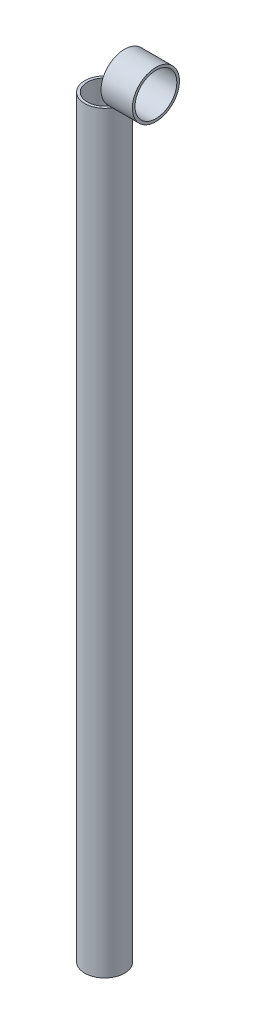
ISO-10303-21;
HEADER;
FILE_DESCRIPTION(('STEP AP214'),'2;1');
FILE_NAME('part.step','',(''),(''),'','','');
FILE_SCHEMA(('AUTOMOTIVE_DESIGN { 1 0 10303 214 1 1 1 1 }'));
ENDSEC;
DATA;
#1=APPLICATION_CONTEXT('core data for automotive mechanical design processes');
#2=APPLICATION_PROTOCOL_DEFINITION('international standard','automotive_design',2000,#1);
#3=PRODUCT_CONTEXT('',#1,'mechanical');
#4=PRODUCT('Part','Part','',(#3));
#5=PRODUCT_RELATED_PRODUCT_CATEGORY('part','',(#4));
#6=PRODUCT_DEFINITION_FORMATION('','',#4);
#7=PRODUCT_DEFINITION_CONTEXT('part definition',#1,'design');
#8=PRODUCT_DEFINITION('design','',#6,#7);
#9=PRODUCT_DEFINITION_SHAPE('','',#8);
#10=(LENGTH_UNIT() NAMED_UNIT(*) SI_UNIT(.MILLI.,.METRE.));
#11=(NAMED_UNIT(*) PLANE_ANGLE_UNIT() SI_UNIT($,.RADIAN.));
#12=(NAMED_UNIT(*) SI_UNIT($,.STERADIAN.) SOLID_ANGLE_UNIT());
#13=UNCERTAINTY_MEASURE_WITH_UNIT(LENGTH_MEASURE(1.E-05),#10,'distance_accuracy_value','');
#14=(GEOMETRIC_REPRESENTATION_CONTEXT(3) GLOBAL_UNCERTAINTY_ASSIGNED_CONTEXT((#13)) GLOBAL_UNIT_ASSIGNED_CONTEXT((#10,
#11,#12)) REPRESENTATION_CONTEXT('',''));
#15=CARTESIAN_POINT('',(0.,0.,0.));
#16=DIRECTION('',(0.,0.,1.));
#17=DIRECTION('',(1.,0.,0.));
#18=AXIS2_PLACEMENT_3D('',#15,#16,#17);
#19=CARTESIAN_POINT('',(62.23,942.975,0.));
#20=DIRECTION('',(1.,0.,0.));
#21=DIRECTION('',(0.,0.,-1.));
#22=AXIS2_PLACEMENT_3D('',#19,#20,#21);
#23=PLANE('',#22);
#24=CARTESIAN_POINT('',(62.23,942.975,0.));
#25=DIRECTION('',(1.,0.,0.));
#26=DIRECTION('',(0.,0.,-1.));
#27=AXIS2_PLACEMENT_3D('',#24,#25,#26);
#28=CIRCLE('',#27,28.575);
#29=CARTESIAN_POINT('',(62.23,942.975,-28.575));
#30=VERTEX_POINT('',#29);
#31=EDGE_CURVE('E11',#30,#30,#28,.T.);
#32=ORIENTED_EDGE('',*,*,#31,.T.);
#33=EDGE_LOOP('',(#32));
#34=FACE_BOUND('',#33,.T.);
#35=CARTESIAN_POINT('',(62.23,942.975,0.));
#36=DIRECTION('',(1.,0.,0.));
#37=DIRECTION('',(0.,0.,-1.));
#38=AXIS2_PLACEMENT_3D('',#35,#36,#37);
#39=CIRCLE('',#38,25.4);
#40=CARTESIAN_POINT('',(62.23,942.975,-25.4));
#41=VERTEX_POINT('',#40);
#42=EDGE_CURVE('E56',#41,#41,#39,.T.);
#43=ORIENTED_EDGE('',*,*,#42,.F.);
#44=EDGE_LOOP('',(#43));
#45=FACE_BOUND('',#44,.T.);
#46=ADVANCED_FACE('F45',(#34,#45),#23,.T.);
#47=CARTESIAN_POINT('',(24.13,942.975,0.));
#48=DIRECTION('',(1.,0.,0.));
#49=DIRECTION('',(0.,0.,-1.));
#50=AXIS2_PLACEMENT_3D('',#47,#48,#49);
#51=PLANE('',#50);
#52=CARTESIAN_POINT('',(24.13,942.975,0.));
#53=DIRECTION('',(1.,0.,0.));
#54=DIRECTION('',(0.,0.,-1.));
#55=AXIS2_PLACEMENT_3D('',#52,#53,#54);
#56=CIRCLE('',#55,28.575);
#57=CARTESIAN_POINT('',(24.13,942.975,-28.575));
#58=VERTEX_POINT('',#57);
#59=EDGE_CURVE('E49',#58,#58,#56,.T.);
#60=ORIENTED_EDGE('',*,*,#59,.F.);
#61=EDGE_LOOP('',(#60));
#62=FACE_BOUND('',#61,.T.);
#63=CARTESIAN_POINT('',(24.13,942.975,0.));
#64=DIRECTION('',(1.,0.,0.));
#65=DIRECTION('',(0.,0.,-1.));
#66=AXIS2_PLACEMENT_3D('',#63,#64,#65);
#67=CIRCLE('',#66,25.4);
#68=CARTESIAN_POINT('',(24.13,942.975,-25.4));
#69=VERTEX_POINT('',#68);
#70=EDGE_CURVE('E58',#69,#69,#67,.T.);
#71=ORIENTED_EDGE('',*,*,#70,.T.);
#72=EDGE_LOOP('',(#71));
#73=FACE_BOUND('',#72,.T.);
#74=ADVANCED_FACE('F68',(#62,#73),#51,.F.);
#75=CARTESIAN_POINT('',(62.23,942.975,0.));
#76=DIRECTION('',(-1.,0.,0.));
#77=DIRECTION('',(0.,0.,1.));
#78=AXIS2_PLACEMENT_3D('',#75,#76,#77);
#79=CYLINDRICAL_SURFACE('',#78,28.575);
#80=ORIENTED_EDGE('',*,*,#31,.F.);
#81=EDGE_LOOP('',(#80));
#82=FACE_BOUND('',#81,.T.);
#83=ORIENTED_EDGE('',*,*,#59,.T.);
#84=EDGE_LOOP('',(#83));
#85=FACE_BOUND('',#84,.T.);
#86=ADVANCED_FACE('F47',(#82,#85),#79,.T.);
#87=CARTESIAN_POINT('',(62.23,942.975,0.));
#88=DIRECTION('',(-1.,0.,0.));
#89=DIRECTION('',(0.,0.,1.));
#90=AXIS2_PLACEMENT_3D('',#87,#88,#89);
#91=CYLINDRICAL_SURFACE('',#90,25.4);
#92=ORIENTED_EDGE('',*,*,#42,.T.);
#93=EDGE_LOOP('',(#92));
#94=FACE_BOUND('',#93,.T.);
#95=ORIENTED_EDGE('',*,*,#70,.F.);
#96=EDGE_LOOP('',(#95));
#97=FACE_BOUND('',#96,.T.);
#98=ADVANCED_FACE('F64',(#94,#97),#91,.F.);
#99=CLOSED_SHELL('',(#46,#74,#86,#98));
#100=MANIFOLD_SOLID_BREP('B2',#99);
#101=CARTESIAN_POINT('',(0.,914.4,0.));
#102=DIRECTION('',(0.,1.,0.));
#103=DIRECTION('',(0.,0.,1.));
#104=AXIS2_PLACEMENT_3D('',#101,#102,#103);
#105=PLANE('',#104);
#106=CARTESIAN_POINT('',(0.,914.4,0.));
#107=DIRECTION('',(0.,1.,0.));
#108=DIRECTION('',(0.,0.,1.));
#109=AXIS2_PLACEMENT_3D('',#106,#107,#108);
#110=CIRCLE('',#109,24.13);
#111=CARTESIAN_POINT('',(0.,914.4,24.13));
#112=VERTEX_POINT('',#111);
#113=EDGE_CURVE('E44',#112,#112,#110,.T.);
#114=ORIENTED_EDGE('',*,*,#113,.T.);
#115=EDGE_LOOP('',(#114));
#116=FACE_BOUND('',#115,.T.);
#117=CARTESIAN_POINT('',(0.,914.4,0.));
#118=DIRECTION('',(0.,1.,0.));
#119=DIRECTION('',(0.,0.,1.));
#120=AXIS2_PLACEMENT_3D('',#117,#118,#119);
#121=CIRCLE('',#120,20.955);
#122=CARTESIAN_POINT('',(0.,914.4,20.955));
#123=VERTEX_POINT('',#122);
#124=EDGE_CURVE('E120',#123,#123,#121,.T.);
#125=ORIENTED_EDGE('',*,*,#124,.F.);
#126=EDGE_LOOP('',(#125));
#127=FACE_BOUND('',#126,.T.);
#128=ADVANCED_FACE('F107',(#116,#127),#105,.T.);
#129=CARTESIAN_POINT('',(0.,0.,0.));
#130=DIRECTION('',(0.,1.,0.));
#131=DIRECTION('',(0.,0.,1.));
#132=AXIS2_PLACEMENT_3D('',#129,#130,#131);
#133=PLANE('',#132);
#134=CARTESIAN_POINT('',(0.,0.,0.));
#135=DIRECTION('',(0.,1.,0.));
#136=DIRECTION('',(0.,0.,1.));
#137=AXIS2_PLACEMENT_3D('',#134,#135,#136);
#138=CIRCLE('',#137,24.13);
#139=CARTESIAN_POINT('',(0.,0.,24.13));
#140=VERTEX_POINT('',#139);
#141=EDGE_CURVE('E111',#140,#140,#138,.T.);
#142=ORIENTED_EDGE('',*,*,#141,.F.);
#143=EDGE_LOOP('',(#142));
#144=FACE_BOUND('',#143,.T.);
#145=CARTESIAN_POINT('',(0.,0.,0.));
#146=DIRECTION('',(0.,1.,0.));
#147=DIRECTION('',(0.,0.,1.));
#148=AXIS2_PLACEMENT_3D('',#145,#146,#147);
#149=CIRCLE('',#148,20.955);
#150=CARTESIAN_POINT('',(0.,0.,20.955));
#151=VERTEX_POINT('',#150);
#152=EDGE_CURVE('E122',#151,#151,#149,.T.);
#153=ORIENTED_EDGE('',*,*,#152,.T.);
#154=EDGE_LOOP('',(#153));
#155=FACE_BOUND('',#154,.T.);
#156=ADVANCED_FACE('F134',(#144,#155),#133,.F.);
#157=CARTESIAN_POINT('',(0.,914.4,0.));
#158=DIRECTION('',(0.,-1.,0.));
#159=DIRECTION('',(0.,0.,-1.));
#160=AXIS2_PLACEMENT_3D('',#157,#158,#159);
#161=CYLINDRICAL_SURFACE('',#160,24.13);
#162=ORIENTED_EDGE('',*,*,#113,.F.);
#163=EDGE_LOOP('',(#162));
#164=FACE_BOUND('',#163,.T.);
#165=ORIENTED_EDGE('',*,*,#141,.T.);
#166=EDGE_LOOP('',(#165));
#167=FACE_BOUND('',#166,.T.);
#168=ADVANCED_FACE('F109',(#164,#167),#161,.T.);
#169=CARTESIAN_POINT('',(0.,914.4,0.));
#170=DIRECTION('',(0.,-1.,0.));
#171=DIRECTION('',(0.,0.,-1.));
#172=AXIS2_PLACEMENT_3D('',#169,#170,#171);
#173=CYLINDRICAL_SURFACE('',#172,20.955);
#174=ORIENTED_EDGE('',*,*,#124,.T.);
#175=EDGE_LOOP('',(#174));
#176=FACE_BOUND('',#175,.T.);
#177=ORIENTED_EDGE('',*,*,#152,.F.);
#178=EDGE_LOOP('',(#177));
#179=FACE_BOUND('',#178,.T.);
#180=ADVANCED_FACE('F130',(#176,#179),#173,.F.);
#181=CLOSED_SHELL('',(#128,#156,#168,#180));
#182=MANIFOLD_SOLID_BREP('B6',#181);
#183=ADVANCED_BREP_SHAPE_REPRESENTATION('',(#18,#100,#182),#14);
#184=SHAPE_DEFINITION_REPRESENTATION(#9,#183);
ENDSEC;
END-ISO-10303-21;
